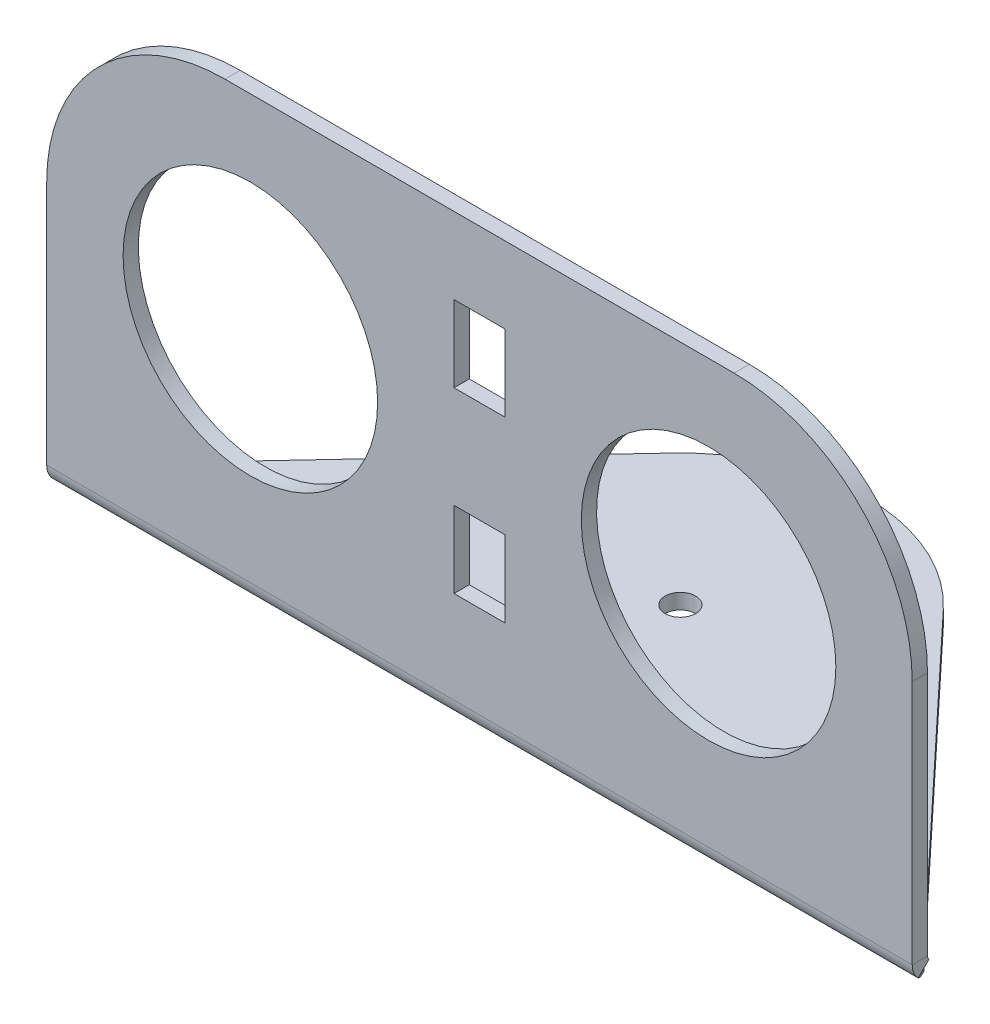
ISO-10303-21;
HEADER;
FILE_DESCRIPTION(('STEP AP214'),'2;1');
FILE_NAME('part.step','',(''),(''),'','','');
FILE_SCHEMA(('AUTOMOTIVE_DESIGN { 1 0 10303 214 1 1 1 1 }'));
ENDSEC;
DATA;
#1=APPLICATION_CONTEXT('core data for automotive mechanical design processes');
#2=APPLICATION_PROTOCOL_DEFINITION('international standard','automotive_design',2000,#1);
#3=PRODUCT_CONTEXT('',#1,'mechanical');
#4=PRODUCT('Part','Part','',(#3));
#5=PRODUCT_RELATED_PRODUCT_CATEGORY('part','',(#4));
#6=PRODUCT_DEFINITION_FORMATION('','',#4);
#7=PRODUCT_DEFINITION_CONTEXT('part definition',#1,'design');
#8=PRODUCT_DEFINITION('design','',#6,#7);
#9=PRODUCT_DEFINITION_SHAPE('','',#8);
#10=(LENGTH_UNIT() NAMED_UNIT(*) SI_UNIT(.MILLI.,.METRE.));
#11=(NAMED_UNIT(*) PLANE_ANGLE_UNIT() SI_UNIT($,.RADIAN.));
#12=(NAMED_UNIT(*) SI_UNIT($,.STERADIAN.) SOLID_ANGLE_UNIT());
#13=UNCERTAINTY_MEASURE_WITH_UNIT(LENGTH_MEASURE(1.E-05),#10,'distance_accuracy_value','');
#14=(GEOMETRIC_REPRESENTATION_CONTEXT(3) GLOBAL_UNCERTAINTY_ASSIGNED_CONTEXT((#13)) GLOBAL_UNIT_ASSIGNED_CONTEXT((#10,
#11,#12)) REPRESENTATION_CONTEXT('',''));
#15=CARTESIAN_POINT('',(0.,0.,0.));
#16=DIRECTION('',(0.,0.,1.));
#17=DIRECTION('',(1.,0.,0.));
#18=AXIS2_PLACEMENT_3D('',#15,#16,#17);
#19=CARTESIAN_POINT('',(-85.,84.154314316016,9.65431431601569));
#20=DIRECTION('',(-1.,0.,0.));
#21=DIRECTION('',(0.,1.,0.));
#22=AXIS2_PLACEMENT_3D('',#19,#20,#21);
#23=PLANE('',#22);
#24=DIRECTION('',(0.,1.,0.));
#25=VECTOR('',#24,1.);
#26=CARTESIAN_POINT('',(-85.,84.154314316016,6.65431431601569));
#27=LINE('',#26,#25);
#28=CARTESIAN_POINT('',(-84.9999999999997,1.00000000000001,6.65431431601598));
#29=VERTEX_POINT('',#28);
#30=CARTESIAN_POINT('',(-85.,49.154314316016,6.65431431601582));
#31=VERTEX_POINT('',#30);
#32=EDGE_CURVE('E239',#29,#31,#27,.T.);
#33=ORIENTED_EDGE('',*,*,#32,.F.);
#34=DIRECTION('',(0.,0.,1.));
#35=VECTOR('',#34,1.);
#36=CARTESIAN_POINT('',(-85.,1.00000000000001,9.65431431601599));
#37=LINE('',#36,#35);
#38=CARTESIAN_POINT('',(-84.9999999999999,1.00000000000004,9.65431431601598));
#39=VERTEX_POINT('',#38);
#40=EDGE_CURVE('E217',#29,#39,#37,.T.);
#41=ORIENTED_EDGE('',*,*,#40,.T.);
#42=DIRECTION('',(0.,1.,0.));
#43=VECTOR('',#42,1.);
#44=CARTESIAN_POINT('',(-85.,84.154314316016,9.65431431601569));
#45=LINE('',#44,#43);
#46=CARTESIAN_POINT('',(-85.,49.154314316016,9.65431431601582));
#47=VERTEX_POINT('',#46);
#48=EDGE_CURVE('E70',#39,#47,#45,.T.);
#49=ORIENTED_EDGE('',*,*,#48,.T.);
#50=DIRECTION('',(0.,0.,-1.));
#51=VECTOR('',#50,1.);
#52=CARTESIAN_POINT('',(-85.,49.154314316016,9.65431431601582));
#53=LINE('',#52,#51);
#54=EDGE_CURVE('E218',#47,#31,#53,.T.);
#55=ORIENTED_EDGE('',*,*,#54,.T.);
#56=EDGE_LOOP('',(#33,#41,#49,#55));
#57=FACE_BOUND('',#56,.T.);
#58=ADVANCED_FACE('F66',(#57),#23,.T.);
#59=CARTESIAN_POINT('',(85.,84.154314316016,9.65431431601569));
#60=DIRECTION('',(1.,0.,0.));
#61=DIRECTION('',(0.,-1.,0.));
#62=AXIS2_PLACEMENT_3D('',#59,#60,#61);
#63=PLANE('',#62);
#64=DIRECTION('',(0.,-1.,0.));
#65=VECTOR('',#64,1.);
#66=CARTESIAN_POINT('',(85.,84.154314316016,9.65431431601569));
#67=LINE('',#66,#65);
#68=CARTESIAN_POINT('',(85.,49.154314316016,9.65431431601582));
#69=VERTEX_POINT('',#68);
#70=CARTESIAN_POINT('',(85.,1.00000000000001,9.65431431601598));
#71=VERTEX_POINT('',#70);
#72=EDGE_CURVE('E237',#69,#71,#67,.T.);
#73=ORIENTED_EDGE('',*,*,#72,.T.);
#74=DIRECTION('',(0.,0.,-1.));
#75=VECTOR('',#74,1.);
#76=CARTESIAN_POINT('',(85.,1.00000000000001,9.65431431601599));
#77=LINE('',#76,#75);
#78=CARTESIAN_POINT('',(85.0000000000001,1.00000000000001,6.65431431601598));
#79=VERTEX_POINT('',#78);
#80=EDGE_CURVE('E12',#71,#79,#77,.T.);
#81=ORIENTED_EDGE('',*,*,#80,.T.);
#82=DIRECTION('',(0.,-1.,0.));
#83=VECTOR('',#82,1.);
#84=CARTESIAN_POINT('',(85.,84.154314316016,6.65431431601569));
#85=LINE('',#84,#83);
#86=CARTESIAN_POINT('',(85.,49.154314316016,6.65431431601582));
#87=VERTEX_POINT('',#86);
#88=EDGE_CURVE('E252',#87,#79,#85,.T.);
#89=ORIENTED_EDGE('',*,*,#88,.F.);
#90=DIRECTION('',(0.,0.,-1.));
#91=VECTOR('',#90,1.);
#92=CARTESIAN_POINT('',(85.,49.154314316016,9.65431431601582));
#93=LINE('',#92,#91);
#94=EDGE_CURVE('E283',#87,#69,#93,.F.);
#95=ORIENTED_EDGE('',*,*,#94,.T.);
#96=EDGE_LOOP('',(#73,#81,#89,#95));
#97=FACE_BOUND('',#96,.T.);
#98=ADVANCED_FACE('F68',(#97),#63,.T.);
#99=CARTESIAN_POINT('',(0.,-8.34568568398399,9.65431431601602));
#100=DIRECTION('',(0.,0.,1.));
#101=DIRECTION('',(0.,-1.,0.));
#102=AXIS2_PLACEMENT_3D('',#99,#100,#101);
#103=PLANE('',#102);
#104=DIRECTION('',(0.,1.,0.));
#105=VECTOR('',#104,1.);
#106=CARTESIAN_POINT('',(5.00000000000002,-8.34568568398399,9.65431431601602));
#107=LINE('',#106,#105);
#108=CARTESIAN_POINT('',(5.00000000000003,54.154314316016,9.6543143160158));
#109=VERTEX_POINT('',#108);
#110=CARTESIAN_POINT('',(5.00000000000003,69.154314316016,9.65431431601575));
#111=VERTEX_POINT('',#110);
#112=EDGE_CURVE('E589',#109,#111,#107,.T.);
#113=ORIENTED_EDGE('',*,*,#112,.F.);
#114=DIRECTION('',(1.,0.,0.));
#115=VECTOR('',#114,1.);
#116=CARTESIAN_POINT('',(0.,54.154314316016,9.6543143160158));
#117=LINE('',#116,#115);
#118=CARTESIAN_POINT('',(-4.99999999999997,54.154314316016,9.6543143160158));
#119=VERTEX_POINT('',#118);
#120=EDGE_CURVE('E544',#119,#109,#117,.T.);
#121=ORIENTED_EDGE('',*,*,#120,.F.);
#122=DIRECTION('',(0.,-1.,0.));
#123=VECTOR('',#122,1.);
#124=CARTESIAN_POINT('',(-4.99999999999998,-8.34568568398399,9.65431431601602));
#125=LINE('',#124,#123);
#126=CARTESIAN_POINT('',(-4.99999999999997,69.154314316016,9.65431431601575));
#127=VERTEX_POINT('',#126);
#128=EDGE_CURVE('E582',#127,#119,#125,.T.);
#129=ORIENTED_EDGE('',*,*,#128,.F.);
#130=DIRECTION('',(-1.,0.,0.));
#131=VECTOR('',#130,1.);
#132=CARTESIAN_POINT('',(0.,69.154314316016,9.65431431601575));
#133=LINE('',#132,#131);
#134=EDGE_CURVE('E586',#111,#127,#133,.T.);
#135=ORIENTED_EDGE('',*,*,#134,.F.);
#136=EDGE_LOOP('',(#113,#121,#129,#135));
#137=FACE_BOUND('',#136,.T.);
#138=DIRECTION('',(0.,1.,0.));
#139=VECTOR('',#138,1.);
#140=CARTESIAN_POINT('',(5.00000000000001,-8.34568568398399,9.65431431601602));
#141=LINE('',#140,#139);
#142=CARTESIAN_POINT('',(5.00000000000002,19.154314316016,9.65431431601592));
#143=VERTEX_POINT('',#142);
#144=CARTESIAN_POINT('',(5.00000000000002,34.154314316016,9.65431431601587));
#145=VERTEX_POINT('',#144);
#146=EDGE_CURVE('E255',#143,#145,#141,.T.);
#147=ORIENTED_EDGE('',*,*,#146,.F.);
#148=DIRECTION('',(1.,0.,0.));
#149=VECTOR('',#148,1.);
#150=CARTESIAN_POINT('',(0.,19.154314316016,9.65431431601592));
#151=LINE('',#150,#149);
#152=CARTESIAN_POINT('',(-4.99999999999999,19.154314316016,9.65431431601592));
#153=VERTEX_POINT('',#152);
#154=EDGE_CURVE('E592',#153,#143,#151,.T.);
#155=ORIENTED_EDGE('',*,*,#154,.F.);
#156=DIRECTION('',(0.,-1.,0.));
#157=VECTOR('',#156,1.);
#158=CARTESIAN_POINT('',(-4.99999999999999,-8.34568568398399,9.65431431601602));
#159=LINE('',#158,#157);
#160=CARTESIAN_POINT('',(-4.99999999999998,34.154314316016,9.65431431601587));
#161=VERTEX_POINT('',#160);
#162=EDGE_CURVE('E595',#161,#153,#159,.T.);
#163=ORIENTED_EDGE('',*,*,#162,.F.);
#164=DIRECTION('',(-1.,0.,0.));
#165=VECTOR('',#164,1.);
#166=CARTESIAN_POINT('',(0.,34.154314316016,9.65431431601587));
#167=LINE('',#166,#165);
#168=EDGE_CURVE('E599',#145,#161,#167,.T.);
#169=ORIENTED_EDGE('',*,*,#168,.F.);
#170=EDGE_LOOP('',(#147,#155,#163,#169));
#171=FACE_BOUND('',#170,.T.);
#172=CARTESIAN_POINT('',(45.,44.154314316016,9.65431431601583));
#173=DIRECTION('',(0.,0.,1.));
#174=DIRECTION('',(0.,-1.,0.));
#175=AXIS2_PLACEMENT_3D('',#172,#173,#174);
#176=CIRCLE('',#175,25.);
#177=CARTESIAN_POINT('',(45.,19.154314316016,9.65431431601592));
#178=VERTEX_POINT('',#177);
#179=EDGE_CURVE('E512',#178,#178,#176,.T.);
#180=ORIENTED_EDGE('',*,*,#179,.F.);
#181=EDGE_LOOP('',(#180));
#182=FACE_BOUND('',#181,.T.);
#183=CARTESIAN_POINT('',(-45.,44.154314316016,9.65431431601583));
#184=DIRECTION('',(0.,0.,1.));
#185=DIRECTION('',(0.,-1.,0.));
#186=AXIS2_PLACEMENT_3D('',#183,#184,#185);
#187=CIRCLE('',#186,25.);
#188=CARTESIAN_POINT('',(-45.,19.154314316016,9.65431431601592));
#189=VERTEX_POINT('',#188);
#190=EDGE_CURVE('E519',#189,#189,#187,.T.);
#191=ORIENTED_EDGE('',*,*,#190,.F.);
#192=EDGE_LOOP('',(#191));
#193=FACE_BOUND('',#192,.T.);
#194=ORIENTED_EDGE('',*,*,#48,.F.);
#195=DIRECTION('',(1.,0.,0.));
#196=VECTOR('',#195,1.);
#197=CARTESIAN_POINT('',(0.,1.00000000000001,9.65431431601598));
#198=LINE('',#197,#196);
#199=EDGE_CURVE('E207',#39,#71,#198,.T.);
#200=ORIENTED_EDGE('',*,*,#199,.T.);
#201=ORIENTED_EDGE('',*,*,#72,.F.);
#202=CARTESIAN_POINT('',(50.,49.154314316016,9.65431431601582));
#203=DIRECTION('',(0.,0.,1.));
#204=DIRECTION('',(0.,-1.,0.));
#205=AXIS2_PLACEMENT_3D('',#202,#203,#204);
#206=CIRCLE('',#205,35.);
#207=CARTESIAN_POINT('',(50.,84.154314316016,9.65431431601569));
#208=VERTEX_POINT('',#207);
#209=EDGE_CURVE('E288',#69,#208,#206,.T.);
#210=ORIENTED_EDGE('',*,*,#209,.T.);
#211=DIRECTION('',(1.,0.,0.));
#212=VECTOR('',#211,1.);
#213=CARTESIAN_POINT('',(-85.,84.154314316016,9.65431431601569));
#214=LINE('',#213,#212);
#215=CARTESIAN_POINT('',(-50.,84.154314316016,9.65431431601569));
#216=VERTEX_POINT('',#215);
#217=EDGE_CURVE('E236',#216,#208,#214,.T.);
#218=ORIENTED_EDGE('',*,*,#217,.F.);
#219=CARTESIAN_POINT('',(-50.,49.154314316016,9.65431431601582));
#220=DIRECTION('',(0.,0.,1.));
#221=DIRECTION('',(0.,-1.,0.));
#222=AXIS2_PLACEMENT_3D('',#219,#220,#221);
#223=CIRCLE('',#222,35.);
#224=EDGE_CURVE('E233',#216,#47,#223,.T.);
#225=ORIENTED_EDGE('',*,*,#224,.T.);
#226=EDGE_LOOP('',(#194,#200,#201,#210,#218,#225));
#227=FACE_BOUND('',#226,.T.);
#228=ADVANCED_FACE('F230',(#137,#171,#182,#193,#227),#103,.T.);
#229=CARTESIAN_POINT('',(-85.,84.154314316016,9.65431431601569));
#230=DIRECTION('',(0.,1.,0.));
#231=DIRECTION('',(1.,0.,0.));
#232=AXIS2_PLACEMENT_3D('',#229,#230,#231);
#233=PLANE('',#232);
#234=ORIENTED_EDGE('',*,*,#217,.T.);
#235=DIRECTION('',(0.,0.,-1.));
#236=VECTOR('',#235,1.);
#237=CARTESIAN_POINT('',(50.,84.154314316016,9.65431431601569));
#238=LINE('',#237,#236);
#239=CARTESIAN_POINT('',(50.,84.154314316016,6.65431431601569));
#240=VERTEX_POINT('',#239);
#241=EDGE_CURVE('E273',#208,#240,#238,.T.);
#242=ORIENTED_EDGE('',*,*,#241,.T.);
#243=DIRECTION('',(1.,0.,0.));
#244=VECTOR('',#243,1.);
#245=CARTESIAN_POINT('',(-85.,84.154314316016,6.65431431601569));
#246=LINE('',#245,#244);
#247=CARTESIAN_POINT('',(-50.,84.154314316016,6.65431431601569));
#248=VERTEX_POINT('',#247);
#249=EDGE_CURVE('E251',#248,#240,#246,.T.);
#250=ORIENTED_EDGE('',*,*,#249,.F.);
#251=DIRECTION('',(0.,0.,-1.));
#252=VECTOR('',#251,1.);
#253=CARTESIAN_POINT('',(-50.,84.154314316016,9.65431431601569));
#254=LINE('',#253,#252);
#255=EDGE_CURVE('E270',#248,#216,#254,.F.);
#256=ORIENTED_EDGE('',*,*,#255,.T.);
#257=EDGE_LOOP('',(#234,#242,#250,#256));
#258=FACE_BOUND('',#257,.T.);
#259=ADVANCED_FACE('F300',(#258),#233,.T.);
#260=CARTESIAN_POINT('',(0.,-8.345685683984,6.65431431601602));
#261=DIRECTION('',(0.,0.,1.));
#262=DIRECTION('',(0.,-1.,0.));
#263=AXIS2_PLACEMENT_3D('',#260,#261,#262);
#264=PLANE('',#263);
#265=DIRECTION('',(1.,0.,0.));
#266=VECTOR('',#265,1.);
#267=CARTESIAN_POINT('',(0.,1.,6.65431431601598));
#268=LINE('',#267,#266);
#269=EDGE_CURVE('E76',#29,#79,#268,.T.);
#270=ORIENTED_EDGE('',*,*,#269,.F.);
#271=ORIENTED_EDGE('',*,*,#32,.T.);
#272=CARTESIAN_POINT('',(-50.,49.154314316016,6.65431431601582));
#273=DIRECTION('',(0.,0.,1.));
#274=DIRECTION('',(0.,-1.,0.));
#275=AXIS2_PLACEMENT_3D('',#272,#273,#274);
#276=CIRCLE('',#275,35.);
#277=EDGE_CURVE('E277',#31,#248,#276,.F.);
#278=ORIENTED_EDGE('',*,*,#277,.T.);
#279=ORIENTED_EDGE('',*,*,#249,.T.);
#280=CARTESIAN_POINT('',(50.,49.154314316016,6.65431431601582));
#281=DIRECTION('',(0.,0.,1.));
#282=DIRECTION('',(0.,-1.,0.));
#283=AXIS2_PLACEMENT_3D('',#280,#281,#282);
#284=CIRCLE('',#283,35.);
#285=EDGE_CURVE('E280',#240,#87,#284,.F.);
#286=ORIENTED_EDGE('',*,*,#285,.T.);
#287=ORIENTED_EDGE('',*,*,#88,.T.);
#288=EDGE_LOOP('',(#270,#271,#278,#279,#286,#287));
#289=FACE_BOUND('',#288,.T.);
#290=CARTESIAN_POINT('',(-45.,44.154314316016,6.65431431601583));
#291=DIRECTION('',(0.,0.,-1.));
#292=DIRECTION('',(0.,1.,0.));
#293=AXIS2_PLACEMENT_3D('',#290,#291,#292);
#294=CIRCLE('',#293,25.);
#295=CARTESIAN_POINT('',(-45.,69.154314316016,6.65431431601575));
#296=VERTEX_POINT('',#295);
#297=EDGE_CURVE('E508',#296,#296,#294,.T.);
#298=ORIENTED_EDGE('',*,*,#297,.F.);
#299=EDGE_LOOP('',(#298));
#300=FACE_BOUND('',#299,.T.);
#301=CARTESIAN_POINT('',(45.,44.154314316016,6.65431431601583));
#302=DIRECTION('',(0.,0.,-1.));
#303=DIRECTION('',(0.,1.,0.));
#304=AXIS2_PLACEMENT_3D('',#301,#302,#303);
#305=CIRCLE('',#304,25.);
#306=CARTESIAN_POINT('',(45.,69.154314316016,6.65431431601575));
#307=VERTEX_POINT('',#306);
#308=EDGE_CURVE('E427',#307,#307,#305,.T.);
#309=ORIENTED_EDGE('',*,*,#308,.F.);
#310=EDGE_LOOP('',(#309));
#311=FACE_BOUND('',#310,.T.);
#312=DIRECTION('',(-1.,0.,0.));
#313=VECTOR('',#312,1.);
#314=CARTESIAN_POINT('',(-4.99999999999999,19.154314316016,6.65431431601592));
#315=LINE('',#314,#313);
#316=CARTESIAN_POINT('',(5.00000000000002,19.154314316016,6.65431431601592));
#317=VERTEX_POINT('',#316);
#318=CARTESIAN_POINT('',(-4.99999999999999,19.154314316016,6.65431431601592));
#319=VERTEX_POINT('',#318);
#320=EDGE_CURVE('E527',#317,#319,#315,.T.);
#321=ORIENTED_EDGE('',*,*,#320,.F.);
#322=DIRECTION('',(0.,-1.,0.));
#323=VECTOR('',#322,1.);
#324=CARTESIAN_POINT('',(5.00000000000002,19.154314316016,6.65431431601592));
#325=LINE('',#324,#323);
#326=CARTESIAN_POINT('',(5.00000000000002,34.154314316016,6.65431431601587));
#327=VERTEX_POINT('',#326);
#328=EDGE_CURVE('E524',#327,#317,#325,.T.);
#329=ORIENTED_EDGE('',*,*,#328,.F.);
#330=DIRECTION('',(1.,0.,0.));
#331=VECTOR('',#330,1.);
#332=CARTESIAN_POINT('',(-4.99999999999998,34.154314316016,6.65431431601587));
#333=LINE('',#332,#331);
#334=CARTESIAN_POINT('',(-4.99999999999998,34.154314316016,6.65431431601587));
#335=VERTEX_POINT('',#334);
#336=EDGE_CURVE('E536',#335,#327,#333,.T.);
#337=ORIENTED_EDGE('',*,*,#336,.F.);
#338=DIRECTION('',(0.,1.,0.));
#339=VECTOR('',#338,1.);
#340=CARTESIAN_POINT('',(-4.99999999999999,19.154314316016,6.65431431601592));
#341=LINE('',#340,#339);
#342=EDGE_CURVE('E532',#319,#335,#341,.T.);
#343=ORIENTED_EDGE('',*,*,#342,.F.);
#344=EDGE_LOOP('',(#321,#329,#337,#343));
#345=FACE_BOUND('',#344,.T.);
#346=DIRECTION('',(-1.,0.,0.));
#347=VECTOR('',#346,1.);
#348=CARTESIAN_POINT('',(-4.99999999999997,54.154314316016,6.6543143160158));
#349=LINE('',#348,#347);
#350=CARTESIAN_POINT('',(5.00000000000003,54.154314316016,6.6543143160158));
#351=VERTEX_POINT('',#350);
#352=CARTESIAN_POINT('',(-4.99999999999997,54.154314316016,6.6543143160158));
#353=VERTEX_POINT('',#352);
#354=EDGE_CURVE('E574',#351,#353,#349,.T.);
#355=ORIENTED_EDGE('',*,*,#354,.F.);
#356=DIRECTION('',(0.,-1.,0.));
#357=VECTOR('',#356,1.);
#358=CARTESIAN_POINT('',(5.00000000000003,54.154314316016,6.6543143160158));
#359=LINE('',#358,#357);
#360=CARTESIAN_POINT('',(5.00000000000003,69.154314316016,6.65431431601575));
#361=VERTEX_POINT('',#360);
#362=EDGE_CURVE('E528',#361,#351,#359,.T.);
#363=ORIENTED_EDGE('',*,*,#362,.F.);
#364=DIRECTION('',(1.,0.,0.));
#365=VECTOR('',#364,1.);
#366=CARTESIAN_POINT('',(-4.99999999999997,69.154314316016,6.65431431601575));
#367=LINE('',#366,#365);
#368=CARTESIAN_POINT('',(-4.99999999999997,69.154314316016,6.65431431601575));
#369=VERTEX_POINT('',#368);
#370=EDGE_CURVE('E558',#369,#361,#367,.T.);
#371=ORIENTED_EDGE('',*,*,#370,.F.);
#372=DIRECTION('',(0.,1.,0.));
#373=VECTOR('',#372,1.);
#374=CARTESIAN_POINT('',(-4.99999999999997,54.154314316016,6.6543143160158));
#375=LINE('',#374,#373);
#376=EDGE_CURVE('E570',#353,#369,#375,.T.);
#377=ORIENTED_EDGE('',*,*,#376,.F.);
#378=EDGE_LOOP('',(#355,#363,#371,#377));
#379=FACE_BOUND('',#378,.T.);
#380=ADVANCED_FACE('F296',(#289,#300,#311,#345,#379),#264,.F.);
#381=CARTESIAN_POINT('',(5.00000000000003,54.154314316016,16.6543143160158));
#382=DIRECTION('',(1.,0.,0.));
#383=DIRECTION('',(0.,-1.,0.));
#384=AXIS2_PLACEMENT_3D('',#381,#382,#383);
#385=PLANE('',#384);
#386=ORIENTED_EDGE('',*,*,#112,.T.);
#387=DIRECTION('',(0.,0.,-1.));
#388=VECTOR('',#387,1.);
#389=CARTESIAN_POINT('',(5.00000000000003,69.154314316016,16.6543143160157));
#390=LINE('',#389,#388);
#391=EDGE_CURVE('E523',#111,#361,#390,.T.);
#392=ORIENTED_EDGE('',*,*,#391,.T.);
#393=ORIENTED_EDGE('',*,*,#362,.T.);
#394=DIRECTION('',(0.,0.,-1.));
#395=VECTOR('',#394,1.);
#396=CARTESIAN_POINT('',(5.00000000000003,54.154314316016,16.6543143160158));
#397=LINE('',#396,#395);
#398=EDGE_CURVE('E554',#109,#351,#397,.T.);
#399=ORIENTED_EDGE('',*,*,#398,.F.);
#400=EDGE_LOOP('',(#386,#392,#393,#399));
#401=FACE_BOUND('',#400,.T.);
#402=ADVANCED_FACE('F645',(#401),#385,.F.);
#403=CARTESIAN_POINT('',(-4.99999999999997,69.154314316016,16.6543143160157));
#404=DIRECTION('',(0.,1.,0.));
#405=DIRECTION('',(1.,0.,0.));
#406=AXIS2_PLACEMENT_3D('',#403,#404,#405);
#407=PLANE('',#406);
#408=ORIENTED_EDGE('',*,*,#134,.T.);
#409=DIRECTION('',(0.,0.,-1.));
#410=VECTOR('',#409,1.);
#411=CARTESIAN_POINT('',(-4.99999999999997,69.154314316016,16.6543143160157));
#412=LINE('',#411,#410);
#413=EDGE_CURVE('E562',#127,#369,#412,.T.);
#414=ORIENTED_EDGE('',*,*,#413,.T.);
#415=ORIENTED_EDGE('',*,*,#370,.T.);
#416=ORIENTED_EDGE('',*,*,#391,.F.);
#417=EDGE_LOOP('',(#408,#414,#415,#416));
#418=FACE_BOUND('',#417,.T.);
#419=ADVANCED_FACE('F650',(#418),#407,.F.);
#420=CARTESIAN_POINT('',(-4.99999999999997,54.154314316016,16.6543143160158));
#421=DIRECTION('',(-1.,0.,0.));
#422=DIRECTION('',(0.,1.,0.));
#423=AXIS2_PLACEMENT_3D('',#420,#421,#422);
#424=PLANE('',#423);
#425=ORIENTED_EDGE('',*,*,#128,.T.);
#426=DIRECTION('',(0.,0.,-1.));
#427=VECTOR('',#426,1.);
#428=CARTESIAN_POINT('',(-4.99999999999997,54.154314316016,16.6543143160158));
#429=LINE('',#428,#427);
#430=EDGE_CURVE('E559',#119,#353,#429,.T.);
#431=ORIENTED_EDGE('',*,*,#430,.T.);
#432=ORIENTED_EDGE('',*,*,#376,.T.);
#433=ORIENTED_EDGE('',*,*,#413,.F.);
#434=EDGE_LOOP('',(#425,#431,#432,#433));
#435=FACE_BOUND('',#434,.T.);
#436=ADVANCED_FACE('F946',(#435),#424,.F.);
#437=CARTESIAN_POINT('',(-4.99999999999997,54.154314316016,16.6543143160158));
#438=DIRECTION('',(0.,-1.,0.));
#439=DIRECTION('',(-1.,0.,0.));
#440=AXIS2_PLACEMENT_3D('',#437,#438,#439);
#441=PLANE('',#440);
#442=ORIENTED_EDGE('',*,*,#120,.T.);
#443=ORIENTED_EDGE('',*,*,#398,.T.);
#444=ORIENTED_EDGE('',*,*,#354,.T.);
#445=ORIENTED_EDGE('',*,*,#430,.F.);
#446=EDGE_LOOP('',(#442,#443,#444,#445));
#447=FACE_BOUND('',#446,.T.);
#448=ADVANCED_FACE('F937',(#447),#441,.F.);
#449=CARTESIAN_POINT('',(5.00000000000002,19.1543143160161,16.6543143160159));
#450=DIRECTION('',(1.,0.,0.));
#451=DIRECTION('',(0.,-1.,0.));
#452=AXIS2_PLACEMENT_3D('',#449,#450,#451);
#453=PLANE('',#452);
#454=ORIENTED_EDGE('',*,*,#146,.T.);
#455=DIRECTION('',(0.,0.,-1.));
#456=VECTOR('',#455,1.);
#457=CARTESIAN_POINT('',(5.00000000000002,34.154314316016,16.6543143160159));
#458=LINE('',#457,#456);
#459=EDGE_CURVE('E541',#145,#327,#458,.T.);
#460=ORIENTED_EDGE('',*,*,#459,.T.);
#461=ORIENTED_EDGE('',*,*,#328,.T.);
#462=DIRECTION('',(0.,0.,-1.));
#463=VECTOR('',#462,1.);
#464=CARTESIAN_POINT('',(5.00000000000002,19.1543143160161,16.6543143160159));
#465=LINE('',#464,#463);
#466=EDGE_CURVE('E540',#143,#317,#465,.T.);
#467=ORIENTED_EDGE('',*,*,#466,.F.);
#468=EDGE_LOOP('',(#454,#460,#461,#467));
#469=FACE_BOUND('',#468,.T.);
#470=ADVANCED_FACE('F608',(#469),#453,.F.);
#471=CARTESIAN_POINT('',(-4.99999999999998,34.154314316016,16.6543143160159));
#472=DIRECTION('',(0.,1.,0.));
#473=DIRECTION('',(1.,0.,0.));
#474=AXIS2_PLACEMENT_3D('',#471,#472,#473);
#475=PLANE('',#474);
#476=ORIENTED_EDGE('',*,*,#168,.T.);
#477=DIRECTION('',(0.,0.,-1.));
#478=VECTOR('',#477,1.);
#479=CARTESIAN_POINT('',(-4.99999999999998,34.154314316016,16.6543143160159));
#480=LINE('',#479,#478);
#481=EDGE_CURVE('E545',#161,#335,#480,.T.);
#482=ORIENTED_EDGE('',*,*,#481,.T.);
#483=ORIENTED_EDGE('',*,*,#336,.T.);
#484=ORIENTED_EDGE('',*,*,#459,.F.);
#485=EDGE_LOOP('',(#476,#482,#483,#484));
#486=FACE_BOUND('',#485,.T.);
#487=ADVANCED_FACE('F613',(#486),#475,.F.);
#488=CARTESIAN_POINT('',(-4.99999999999999,19.1543143160161,16.6543143160159));
#489=DIRECTION('',(-1.,0.,0.));
#490=DIRECTION('',(0.,1.,0.));
#491=AXIS2_PLACEMENT_3D('',#488,#489,#490);
#492=PLANE('',#491);
#493=ORIENTED_EDGE('',*,*,#162,.T.);
#494=DIRECTION('',(0.,0.,-1.));
#495=VECTOR('',#494,1.);
#496=CARTESIAN_POINT('',(-4.99999999999999,19.1543143160161,16.6543143160159));
#497=LINE('',#496,#495);
#498=EDGE_CURVE('E548',#153,#319,#497,.T.);
#499=ORIENTED_EDGE('',*,*,#498,.T.);
#500=ORIENTED_EDGE('',*,*,#342,.T.);
#501=ORIENTED_EDGE('',*,*,#481,.F.);
#502=EDGE_LOOP('',(#493,#499,#500,#501));
#503=FACE_BOUND('',#502,.T.);
#504=ADVANCED_FACE('F620',(#503),#492,.F.);
#505=CARTESIAN_POINT('',(-4.99999999999999,19.1543143160161,16.6543143160159));
#506=DIRECTION('',(0.,-1.,0.));
#507=DIRECTION('',(-1.,0.,0.));
#508=AXIS2_PLACEMENT_3D('',#505,#506,#507);
#509=PLANE('',#508);
#510=ORIENTED_EDGE('',*,*,#154,.T.);
#511=ORIENTED_EDGE('',*,*,#466,.T.);
#512=ORIENTED_EDGE('',*,*,#320,.T.);
#513=ORIENTED_EDGE('',*,*,#498,.F.);
#514=EDGE_LOOP('',(#510,#511,#512,#513));
#515=FACE_BOUND('',#514,.T.);
#516=ADVANCED_FACE('F626',(#515),#509,.F.);
#517=CARTESIAN_POINT('',(45.,44.154314316016,16.6543143160158));
#518=DIRECTION('',(0.,0.,-1.));
#519=DIRECTION('',(0.,1.,0.));
#520=AXIS2_PLACEMENT_3D('',#517,#518,#519);
#521=CYLINDRICAL_SURFACE('',#520,25.);
#522=ORIENTED_EDGE('',*,*,#179,.T.);
#523=EDGE_LOOP('',(#522));
#524=FACE_BOUND('',#523,.T.);
#525=ORIENTED_EDGE('',*,*,#308,.T.);
#526=EDGE_LOOP('',(#525));
#527=FACE_BOUND('',#526,.T.);
#528=ADVANCED_FACE('F628',(#524,#527),#521,.F.);
#529=CARTESIAN_POINT('',(-45.,44.154314316016,16.6543143160158));
#530=DIRECTION('',(0.,0.,-1.));
#531=DIRECTION('',(0.,1.,0.));
#532=AXIS2_PLACEMENT_3D('',#529,#530,#531);
#533=CYLINDRICAL_SURFACE('',#532,25.);
#534=ORIENTED_EDGE('',*,*,#190,.T.);
#535=EDGE_LOOP('',(#534));
#536=FACE_BOUND('',#535,.T.);
#537=ORIENTED_EDGE('',*,*,#297,.T.);
#538=EDGE_LOOP('',(#537));
#539=FACE_BOUND('',#538,.T.);
#540=ADVANCED_FACE('F490',(#536,#539),#533,.F.);
#541=CARTESIAN_POINT('',(50.,49.154314316016,9.65431431601582));
#542=DIRECTION('',(0.,0.,-1.));
#543=DIRECTION('',(0.,1.,0.));
#544=AXIS2_PLACEMENT_3D('',#541,#542,#543);
#545=CYLINDRICAL_SURFACE('',#544,35.);
#546=ORIENTED_EDGE('',*,*,#209,.F.);
#547=ORIENTED_EDGE('',*,*,#94,.F.);
#548=ORIENTED_EDGE('',*,*,#285,.F.);
#549=ORIENTED_EDGE('',*,*,#241,.F.);
#550=EDGE_LOOP('',(#546,#547,#548,#549));
#551=FACE_BOUND('',#550,.T.);
#552=ADVANCED_FACE('F304',(#551),#545,.T.);
#553=CARTESIAN_POINT('',(-50.,49.154314316016,9.65431431601582));
#554=DIRECTION('',(0.,0.,-1.));
#555=DIRECTION('',(0.,1.,0.));
#556=AXIS2_PLACEMENT_3D('',#553,#554,#555);
#557=CYLINDRICAL_SURFACE('',#556,35.);
#558=ORIENTED_EDGE('',*,*,#224,.F.);
#559=ORIENTED_EDGE('',*,*,#255,.F.);
#560=ORIENTED_EDGE('',*,*,#277,.F.);
#561=ORIENTED_EDGE('',*,*,#54,.F.);
#562=EDGE_LOOP('',(#558,#559,#560,#561));
#563=FACE_BOUND('',#562,.T.);
#564=ADVANCED_FACE('F294',(#563),#557,.T.);
#565=CARTESIAN_POINT('',(0.,-10.,-29.8072357498176));
#566=DIRECTION('',(0.,1.,0.));
#567=DIRECTION('',(0.,0.,1.));
#568=AXIS2_PLACEMENT_3D('',#565,#566,#567);
#569=CYLINDRICAL_SURFACE('',#568,3.);
#570=CARTESIAN_POINT('',(0.,-3.,-29.8072357498176));
#571=DIRECTION('',(0.,-1.,0.));
#572=DIRECTION('',(0.,0.,-1.));
#573=AXIS2_PLACEMENT_3D('',#570,#571,#572);
#574=CIRCLE('',#573,3.);
#575=CARTESIAN_POINT('',(0.,-3.,-32.8072357498176));
#576=VERTEX_POINT('',#575);
#577=EDGE_CURVE('E446',#576,#576,#574,.T.);
#578=ORIENTED_EDGE('',*,*,#577,.T.);
#579=EDGE_LOOP('',(#578));
#580=FACE_BOUND('',#579,.T.);
#581=CARTESIAN_POINT('',(0.,0.,-29.8072357498176));
#582=DIRECTION('',(0.,1.,0.));
#583=DIRECTION('',(0.,0.,1.));
#584=AXIS2_PLACEMENT_3D('',#581,#582,#583);
#585=CIRCLE('',#584,3.);
#586=CARTESIAN_POINT('',(0.,0.,-26.8072357498176));
#587=VERTEX_POINT('',#586);
#588=EDGE_CURVE('E442',#587,#587,#585,.T.);
#589=ORIENTED_EDGE('',*,*,#588,.T.);
#590=EDGE_LOOP('',(#589));
#591=FACE_BOUND('',#590,.T.);
#592=ADVANCED_FACE('F412',(#580,#591),#569,.F.);
#593=CARTESIAN_POINT('',(0.,-10.,-29.8072357498176));
#594=DIRECTION('',(0.,1.,0.));
#595=DIRECTION('',(0.,0.,1.));
#596=AXIS2_PLACEMENT_3D('',#593,#594,#595);
#597=CYLINDRICAL_SURFACE('',#596,36.5348167139105);
#598=DIRECTION('',(0.,1.,0.));
#599=VECTOR('',#598,1.);
#600=CARTESIAN_POINT('',(-26.6652480918724,-10.,-54.7823709149759));
#601=LINE('',#600,#599);
#602=CARTESIAN_POINT('',(-26.6652480918724,-3.,-54.7823709149759));
#603=VERTEX_POINT('',#602);
#604=CARTESIAN_POINT('',(-26.6652480918724,0.,-54.7823709149759));
#605=VERTEX_POINT('',#604);
#606=EDGE_CURVE('E438',#603,#605,#601,.T.);
#607=ORIENTED_EDGE('',*,*,#606,.T.);
#608=CARTESIAN_POINT('',(0.,0.,-29.8072357498176));
#609=DIRECTION('',(0.,1.,0.));
#610=DIRECTION('',(0.,0.,1.));
#611=AXIS2_PLACEMENT_3D('',#608,#609,#610);
#612=CIRCLE('',#611,36.5348167139105);
#613=CARTESIAN_POINT('',(26.6652480918724,0.,-54.7823709149759));
#614=VERTEX_POINT('',#613);
#615=EDGE_CURVE('E428',#614,#605,#612,.T.);
#616=ORIENTED_EDGE('',*,*,#615,.F.);
#617=DIRECTION('',(0.,1.,0.));
#618=VECTOR('',#617,1.);
#619=CARTESIAN_POINT('',(26.6652480918724,-10.,-54.7823709149759));
#620=LINE('',#619,#618);
#621=CARTESIAN_POINT('',(26.6652480918724,-3.,-54.7823709149759));
#622=VERTEX_POINT('',#621);
#623=EDGE_CURVE('E418',#622,#614,#620,.T.);
#624=ORIENTED_EDGE('',*,*,#623,.F.);
#625=CARTESIAN_POINT('',(0.,-3.,-29.8072357498176));
#626=DIRECTION('',(0.,-1.,0.));
#627=DIRECTION('',(0.,0.,-1.));
#628=AXIS2_PLACEMENT_3D('',#625,#626,#627);
#629=CIRCLE('',#628,36.5348167139105);
#630=EDGE_CURVE('E433',#603,#622,#629,.T.);
#631=ORIENTED_EDGE('',*,*,#630,.F.);
#632=EDGE_LOOP('',(#607,#616,#624,#631));
#633=FACE_BOUND('',#632,.T.);
#634=ADVANCED_FACE('F666',(#633),#597,.T.);
#635=CARTESIAN_POINT('',(0.,-3.,0.));
#636=DIRECTION('',(0.,-1.,0.));
#637=DIRECTION('',(0.,0.,-1.));
#638=AXIS2_PLACEMENT_3D('',#635,#636,#637);
#639=PLANE('',#638);
#640=DIRECTION('',(1.,0.,0.));
#641=VECTOR('',#640,1.);
#642=CARTESIAN_POINT('',(0.,-3.,5.65431431601598));
#643=LINE('',#642,#641);
#644=CARTESIAN_POINT('',(-83.2712986854244,-3.,5.65431431601597));
#645=VERTEX_POINT('',#644);
#646=CARTESIAN_POINT('',(83.2712986854246,-3.,5.65431431601598));
#647=VERTEX_POINT('',#646);
#648=EDGE_CURVE('E469',#645,#647,#643,.T.);
#649=ORIENTED_EDGE('',*,*,#648,.F.);
#650=DIRECTION('',(-0.683598206081848,0.,0.729858542898334));
#651=VECTOR('',#650,1.);
#652=CARTESIAN_POINT('',(-41.5369719449016,-3.,-38.9042503974117));
#653=LINE('',#652,#651);
#654=EDGE_CURVE('E685',#603,#645,#653,.T.);
#655=ORIENTED_EDGE('',*,*,#654,.F.);
#656=ORIENTED_EDGE('',*,*,#630,.T.);
#657=DIRECTION('',(0.683598206081848,0.,0.729858542898334));
#658=VECTOR('',#657,1.);
#659=CARTESIAN_POINT('',(41.5369719449016,-3.,-38.9042503974117));
#660=LINE('',#659,#658);
#661=EDGE_CURVE('E437',#622,#647,#660,.T.);
#662=ORIENTED_EDGE('',*,*,#661,.T.);
#663=EDGE_LOOP('',(#649,#655,#656,#662));
#664=FACE_BOUND('',#663,.T.);
#665=ORIENTED_EDGE('',*,*,#577,.F.);
#666=EDGE_LOOP('',(#665));
#667=FACE_BOUND('',#666,.T.);
#668=ADVANCED_FACE('F482',(#664,#667),#639,.T.);
#669=CARTESIAN_POINT('',(-41.5369719449016,-10.,-38.9042503974117));
#670=DIRECTION('',(0.729858542898334,0.,0.683598206081848));
#671=DIRECTION('',(0.683598206081848,0.,-0.729858542898334));
#672=AXIS2_PLACEMENT_3D('',#669,#670,#671);
#673=PLANE('',#672);
#674=ORIENTED_EDGE('',*,*,#654,.T.);
#675=CARTESIAN_POINT('',(-83.2712986854244,0.,5.65431431601598));
#676=CARTESIAN_POINT('',(-83.2712986854244,-3.,5.65431431601597));
#677=B_SPLINE_CURVE_WITH_KNOTS('',1,(#675,#676),.UNSPECIFIED.,.F.,.F.,(2,2),(0.,1.),.UNSPECIFIED.);
#678=CARTESIAN_POINT('',(-83.2712986854246,0.,5.65431431601597));
#679=VERTEX_POINT('',#678);
#680=EDGE_CURVE('E387',#645,#679,#677,.F.);
#681=ORIENTED_EDGE('',*,*,#680,.T.);
#682=DIRECTION('',(0.683598206081848,0.,-0.729858542898334));
#683=VECTOR('',#682,1.);
#684=CARTESIAN_POINT('',(-41.5369719449016,0.,-38.9042503974117));
#685=LINE('',#684,#683);
#686=EDGE_CURVE('E455',#679,#605,#685,.T.);
#687=ORIENTED_EDGE('',*,*,#686,.T.);
#688=ORIENTED_EDGE('',*,*,#606,.F.);
#689=EDGE_LOOP('',(#674,#681,#687,#688));
#690=FACE_BOUND('',#689,.T.);
#691=ADVANCED_FACE('F471',(#690),#673,.F.);
#692=CARTESIAN_POINT('',(0.,0.,0.));
#693=DIRECTION('',(0.,-1.,0.));
#694=DIRECTION('',(0.,0.,-1.));
#695=AXIS2_PLACEMENT_3D('',#692,#693,#694);
#696=PLANE('',#695);
#697=ORIENTED_EDGE('',*,*,#588,.F.);
#698=EDGE_LOOP('',(#697));
#699=FACE_BOUND('',#698,.T.);
#700=ORIENTED_EDGE('',*,*,#686,.F.);
#701=DIRECTION('',(1.,0.,0.));
#702=VECTOR('',#701,1.);
#703=CARTESIAN_POINT('',(0.,0.,5.65431431601598));
#704=LINE('',#703,#702);
#705=CARTESIAN_POINT('',(83.2712986854247,0.,5.65431431601598));
#706=VERTEX_POINT('',#705);
#707=EDGE_CURVE('E451',#679,#706,#704,.T.);
#708=ORIENTED_EDGE('',*,*,#707,.T.);
#709=DIRECTION('',(-0.683598206081848,0.,-0.729858542898334));
#710=VECTOR('',#709,1.);
#711=CARTESIAN_POINT('',(41.5369719449016,0.,-38.9042503974117));
#712=LINE('',#711,#710);
#713=EDGE_CURVE('E432',#706,#614,#712,.T.);
#714=ORIENTED_EDGE('',*,*,#713,.T.);
#715=ORIENTED_EDGE('',*,*,#615,.T.);
#716=EDGE_LOOP('',(#700,#708,#714,#715));
#717=FACE_BOUND('',#716,.T.);
#718=ADVANCED_FACE('F481',(#699,#717),#696,.F.);
#719=CARTESIAN_POINT('',(41.5369719449016,-10.,-38.9042503974117));
#720=DIRECTION('',(0.729858542898334,0.,-0.683598206081848));
#721=DIRECTION('',(-0.683598206081848,0.,-0.729858542898334));
#722=AXIS2_PLACEMENT_3D('',#719,#720,#721);
#723=PLANE('',#722);
#724=CARTESIAN_POINT('',(83.2712986854247,-3.,5.65431431601598));
#725=CARTESIAN_POINT('',(83.2712986854247,0.,5.65431431601598));
#726=B_SPLINE_CURVE_WITH_KNOTS('',1,(#724,#725),.UNSPECIFIED.,.F.,.F.,(2,2),(0.,1.),.UNSPECIFIED.);
#727=EDGE_CURVE('E450',#647,#706,#726,.T.);
#728=ORIENTED_EDGE('',*,*,#727,.F.);
#729=ORIENTED_EDGE('',*,*,#661,.F.);
#730=ORIENTED_EDGE('',*,*,#623,.T.);
#731=ORIENTED_EDGE('',*,*,#713,.F.);
#732=EDGE_LOOP('',(#728,#729,#730,#731));
#733=FACE_BOUND('',#732,.T.);
#734=ADVANCED_FACE('F408',(#733),#723,.T.);
#735=CARTESIAN_POINT('',(-84.9999999999999,1.,5.65431431601598));
#736=DIRECTION('',(-1.,0.,0.));
#737=DIRECTION('',(0.,0.,1.));
#738=AXIS2_PLACEMENT_3D('',#735,#736,#737);
#739=PLANE('',#738);
#740=ORIENTED_EDGE('',*,*,#40,.F.);
#741=CARTESIAN_POINT('',(-84.9999999999998,1.,5.65431431601598));
#742=DIRECTION('',(-1.,0.,0.));
#743=DIRECTION('',(0.,0.,1.));
#744=AXIS2_PLACEMENT_3D('',#741,#742,#743);
#745=CIRCLE('',#744,1.);
#746=CARTESIAN_POINT('',(-84.9999999999998,0.292893218813456,6.36142109720253));
#747=VERTEX_POINT('',#746);
#748=EDGE_CURVE('E738',#29,#747,#745,.F.);
#749=ORIENTED_EDGE('',*,*,#748,.T.);
#750=CARTESIAN_POINT('',(-84.9999999999998,-1.82842712474617,8.48274144076219));
#751=CARTESIAN_POINT('',(-84.9999999999997,0.292893218813457,6.36142109720253));
#752=B_SPLINE_CURVE_WITH_KNOTS('',1,(#750,#751),.UNSPECIFIED.,.F.,.F.,(2,2),(0.,1.),.UNSPECIFIED.);
#753=CARTESIAN_POINT('',(-84.9999999999999,-1.82842712474618,8.48274144076218));
#754=VERTEX_POINT('',#753);
#755=EDGE_CURVE('E224',#747,#754,#752,.F.);
#756=ORIENTED_EDGE('',*,*,#755,.T.);
#757=CARTESIAN_POINT('',(-84.9999999999999,1.,5.65431431601598));
#758=DIRECTION('',(1.,0.,0.));
#759=DIRECTION('',(0.,0.,1.));
#760=AXIS2_PLACEMENT_3D('',#757,#758,#759);
#761=CIRCLE('',#760,4.);
#762=EDGE_CURVE('E211',#39,#754,#761,.T.);
#763=ORIENTED_EDGE('',*,*,#762,.F.);
#764=EDGE_LOOP('',(#740,#749,#756,#763));
#765=FACE_BOUND('',#764,.T.);
#766=ADVANCED_FACE('F221',(#765),#739,.T.);
#767=CARTESIAN_POINT('',(-84.9999999999998,-1.82842712474617,8.48274144076219));
#768=CARTESIAN_POINT('',(-84.7118432407907,-2.19871860836195,8.11244995714642));
#769=CARTESIAN_POINT('',(-84.4237662284747,-2.49514555341703,7.66879023749959));
#770=CARTESIAN_POINT('',(-83.8475324569496,-2.89589070667326,6.7013058534531));
#771=CARTESIAN_POINT('',(-83.5594554446335,-3.,6.17798555417661));
#772=CARTESIAN_POINT('',(-83.2712986854244,-3.,5.65431431601597));
#773=CARTESIAN_POINT('',(-84.9999999999997,0.292893218813457,6.36142109720253));
#774=CARTESIAN_POINT('',(-84.7118742262948,0.200330302272872,6.26885818066194));
#775=CARTESIAN_POINT('',(-84.4237662284746,0.126213611645739,6.15793329638689));
#776=CARTESIAN_POINT('',(-83.8475324569495,0.0260273233316907,5.91606220037526));
#777=CARTESIAN_POINT('',(-83.5594244591293,0.,5.78521804796051));
#778=CARTESIAN_POINT('',(-83.2712986854244,0.,5.65431431601598));
#779=B_SPLINE_SURFACE_WITH_KNOTS('',1,3,((#767,#768,#769,#770,#771,#772),(#773,#774,#775,#776,
#777,#778)),.UNSPECIFIED.,.F.,.F.,.F.,(2,2),(4,2,4),(0.,1.),(0.,0.5,1.),.UNSPECIFIED.);
#780=CARTESIAN_POINT('',(-84.9999999999997,0.292893218813457,6.36142109720253));
#781=CARTESIAN_POINT('',(-84.7118742262948,0.200330302272872,6.26885818066194));
#782=CARTESIAN_POINT('',(-84.4237662284746,0.126213611645739,6.15793329638689));
#783=CARTESIAN_POINT('',(-83.8475324569495,0.0260273233316907,5.91606220037526));
#784=CARTESIAN_POINT('',(-83.5594244591293,0.,5.78521804796051));
#785=CARTESIAN_POINT('',(-83.2712986854244,0.,5.65431431601598));
#786=B_SPLINE_CURVE_WITH_KNOTS('',3,(#780,#781,#782,#783,#784,#785),.UNSPECIFIED.,.F.,.F.,(4,2,
4),(0.,0.5,1.),.UNSPECIFIED.);
#787=EDGE_CURVE('E323',#747,#679,#786,.T.);
#788=CARTESIAN_POINT('',(-83.2712986854244,-3.,5.65431431601597));
#789=CARTESIAN_POINT('',(-83.5594554446335,-3.,6.17798555417661));
#790=CARTESIAN_POINT('',(-83.8475324569496,-2.89589070667326,6.7013058534531));
#791=CARTESIAN_POINT('',(-84.4237662284747,-2.49514555341703,7.66879023749959));
#792=CARTESIAN_POINT('',(-84.7118432407907,-2.19871860836195,8.11244995714642));
#793=CARTESIAN_POINT('',(-84.9999999999998,-1.82842712474617,8.48274144076219));
#794=B_SPLINE_CURVE_WITH_KNOTS('',3,(#788,#789,#790,#791,#792,#793),.UNSPECIFIED.,.F.,.F.,(4,2,
4),(0.,0.5,1.),.UNSPECIFIED.);
#795=EDGE_CURVE('E227',#754,#645,#794,.F.);
#796=ORIENTED_EDGE('',*,*,#755,.F.);
#797=ORIENTED_EDGE('',*,*,#787,.T.);
#798=ORIENTED_EDGE('',*,*,#680,.F.);
#799=ORIENTED_EDGE('',*,*,#795,.F.);
#800=EDGE_LOOP('',(#796,#797,#798,#799));
#801=FACE_BOUND('',#800,.T.);
#802=ADVANCED_FACE('F353',(#801),#779,.T.);
#803=CARTESIAN_POINT('',(83.2712986854247,-3.,5.65431431601598));
#804=CARTESIAN_POINT('',(83.5594554446338,-3.,6.17798555417666));
#805=CARTESIAN_POINT('',(83.8475324569498,-2.89589070667326,6.70130585345311));
#806=CARTESIAN_POINT('',(84.4237662284749,-2.49514555341702,7.66879023749959));
#807=CARTESIAN_POINT('',(84.7118432407909,-2.19871860836195,8.11244995714641));
#808=CARTESIAN_POINT('',(85.0000000000001,-1.82842712474617,8.48274144076219));
#809=CARTESIAN_POINT('',(83.2712986854247,0.,5.65431431601598));
#810=CARTESIAN_POINT('',(83.5594244591297,0.,5.78521804796054));
#811=CARTESIAN_POINT('',(83.8475324569498,0.0260273233316836,5.91606220037526));
#812=CARTESIAN_POINT('',(84.4237662284749,0.126213611645746,6.15793329638688));
#813=CARTESIAN_POINT('',(84.7118742262952,0.20033030227286,6.26885818066194));
#814=CARTESIAN_POINT('',(85.0000000000001,0.292893218813457,6.36142109720253));
#815=B_SPLINE_SURFACE_WITH_KNOTS('',1,3,((#803,#804,#805,#806,#807,#808),(#809,#810,#811,#812,
#813,#814)),.UNSPECIFIED.,.F.,.F.,.F.,(2,2),(4,2,4),(0.,1.),(0.,0.5,1.),.UNSPECIFIED.);
#816=CARTESIAN_POINT('',(83.2712986854247,0.,5.65431431601598));
#817=CARTESIAN_POINT('',(83.5594244591297,0.,5.78521804796054));
#818=CARTESIAN_POINT('',(83.8475324569498,0.0260273233316836,5.91606220037526));
#819=CARTESIAN_POINT('',(84.4237662284749,0.126213611645746,6.15793329638688));
#820=CARTESIAN_POINT('',(84.7118742262952,0.20033030227286,6.26885818066194));
#821=CARTESIAN_POINT('',(85.0000000000001,0.292893218813457,6.36142109720253));
#822=B_SPLINE_CURVE_WITH_KNOTS('',3,(#816,#817,#818,#819,#820,#821),.UNSPECIFIED.,.F.,.F.,(4,2,
4),(0.,0.5,1.),.UNSPECIFIED.);
#823=CARTESIAN_POINT('',(85.0000000000001,0.292893218813457,6.36142109720253));
#824=VERTEX_POINT('',#823);
#825=EDGE_CURVE('E318',#706,#824,#822,.T.);
#826=CARTESIAN_POINT('',(85.0000000000001,0.292893218813457,6.36142109720253));
#827=CARTESIAN_POINT('',(85.0000000000001,-1.82842712474617,8.48274144076219));
#828=B_SPLINE_CURVE_WITH_KNOTS('',1,(#826,#827),.UNSPECIFIED.,.F.,.F.,(2,2),(0.,1.),.UNSPECIFIED.);
#829=CARTESIAN_POINT('',(85.0000000000001,-1.82842712474617,8.48274144076219));
#830=VERTEX_POINT('',#829);
#831=EDGE_CURVE('E312',#824,#830,#828,.T.);
#832=CARTESIAN_POINT('',(85.0000000000001,-1.82842712474617,8.48274144076219));
#833=CARTESIAN_POINT('',(84.7118432407909,-2.19871860836195,8.11244995714641));
#834=CARTESIAN_POINT('',(84.4237662284749,-2.49514555341702,7.66879023749959));
#835=CARTESIAN_POINT('',(83.8475324569498,-2.89589070667326,6.70130585345311));
#836=CARTESIAN_POINT('',(83.5594554446338,-3.,6.17798555417666));
#837=CARTESIAN_POINT('',(83.2712986854247,-3.,5.65431431601598));
#838=B_SPLINE_CURVE_WITH_KNOTS('',3,(#832,#833,#834,#835,#836,#837),.UNSPECIFIED.,.F.,.F.,(4,2,
4),(0.,0.5,1.),.UNSPECIFIED.);
#839=EDGE_CURVE('E335',#647,#830,#838,.F.);
#840=ORIENTED_EDGE('',*,*,#727,.T.);
#841=ORIENTED_EDGE('',*,*,#825,.T.);
#842=ORIENTED_EDGE('',*,*,#831,.T.);
#843=ORIENTED_EDGE('',*,*,#839,.F.);
#844=EDGE_LOOP('',(#840,#841,#842,#843));
#845=FACE_BOUND('',#844,.T.);
#846=ADVANCED_FACE('F342',(#845),#815,.T.);
#847=CARTESIAN_POINT('',(85.,1.,5.65431431601598));
#848=DIRECTION('',(1.,0.,0.));
#849=DIRECTION('',(0.,0.,-1.));
#850=AXIS2_PLACEMENT_3D('',#847,#848,#849);
#851=PLANE('',#850);
#852=CARTESIAN_POINT('',(85.0000000000001,1.,5.65431431601598));
#853=DIRECTION('',(-1.,0.,0.));
#854=DIRECTION('',(0.,0.,1.));
#855=AXIS2_PLACEMENT_3D('',#852,#853,#854);
#856=CIRCLE('',#855,1.);
#857=EDGE_CURVE('E228',#824,#79,#856,.T.);
#858=ORIENTED_EDGE('',*,*,#857,.T.);
#859=ORIENTED_EDGE('',*,*,#80,.F.);
#860=CARTESIAN_POINT('',(85.,1.,5.65431431601598));
#861=DIRECTION('',(-1.,0.,0.));
#862=DIRECTION('',(0.,0.,-1.));
#863=AXIS2_PLACEMENT_3D('',#860,#861,#862);
#864=CIRCLE('',#863,4.);
#865=EDGE_CURVE('E84',#830,#71,#864,.T.);
#866=ORIENTED_EDGE('',*,*,#865,.F.);
#867=ORIENTED_EDGE('',*,*,#831,.F.);
#868=EDGE_LOOP('',(#858,#859,#866,#867));
#869=FACE_BOUND('',#868,.T.);
#870=ADVANCED_FACE('F310',(#869),#851,.T.);
#871=CARTESIAN_POINT('',(170.066534693267,1.,5.65431431601598));
#872=DIRECTION('',(-1.,0.,0.));
#873=DIRECTION('',(0.,0.,1.));
#874=AXIS2_PLACEMENT_3D('',#871,#872,#873);
#875=CYLINDRICAL_SURFACE('',#874,4.);
#876=ORIENTED_EDGE('',*,*,#839,.T.);
#877=ORIENTED_EDGE('',*,*,#865,.T.);
#878=ORIENTED_EDGE('',*,*,#199,.F.);
#879=ORIENTED_EDGE('',*,*,#762,.T.);
#880=ORIENTED_EDGE('',*,*,#795,.T.);
#881=ORIENTED_EDGE('',*,*,#648,.T.);
#882=EDGE_LOOP('',(#876,#877,#878,#879,#880,#881));
#883=FACE_BOUND('',#882,.T.);
#884=ADVANCED_FACE('F209',(#883),#875,.T.);
#885=CARTESIAN_POINT('',(170.066534693267,1.,5.65431431601598));
#886=DIRECTION('',(-1.,0.,0.));
#887=DIRECTION('',(0.,0.,1.));
#888=AXIS2_PLACEMENT_3D('',#885,#886,#887);
#889=CYLINDRICAL_SURFACE('',#888,1.);
#890=ORIENTED_EDGE('',*,*,#825,.F.);
#891=ORIENTED_EDGE('',*,*,#707,.F.);
#892=ORIENTED_EDGE('',*,*,#787,.F.);
#893=ORIENTED_EDGE('',*,*,#748,.F.);
#894=ORIENTED_EDGE('',*,*,#269,.T.);
#895=ORIENTED_EDGE('',*,*,#857,.F.);
#896=EDGE_LOOP('',(#890,#891,#892,#893,#894,#895));
#897=FACE_BOUND('',#896,.T.);
#898=ADVANCED_FACE('F354',(#897),#889,.F.);
#899=CLOSED_SHELL('',(#58,#98,#228,#259,#380,#402,#419,#436,#448,#470,#487,#504,#516,#528,#540,
#552,#564,#592,#634,#668,#691,#718,#734,#766,#802,#846,#870,#884,#898));
#900=MANIFOLD_SOLID_BREP('B2',#899);
#901=ADVANCED_BREP_SHAPE_REPRESENTATION('',(#18,#900),#14);
#902=SHAPE_DEFINITION_REPRESENTATION(#9,#901);
ENDSEC;
END-ISO-10303-21;
